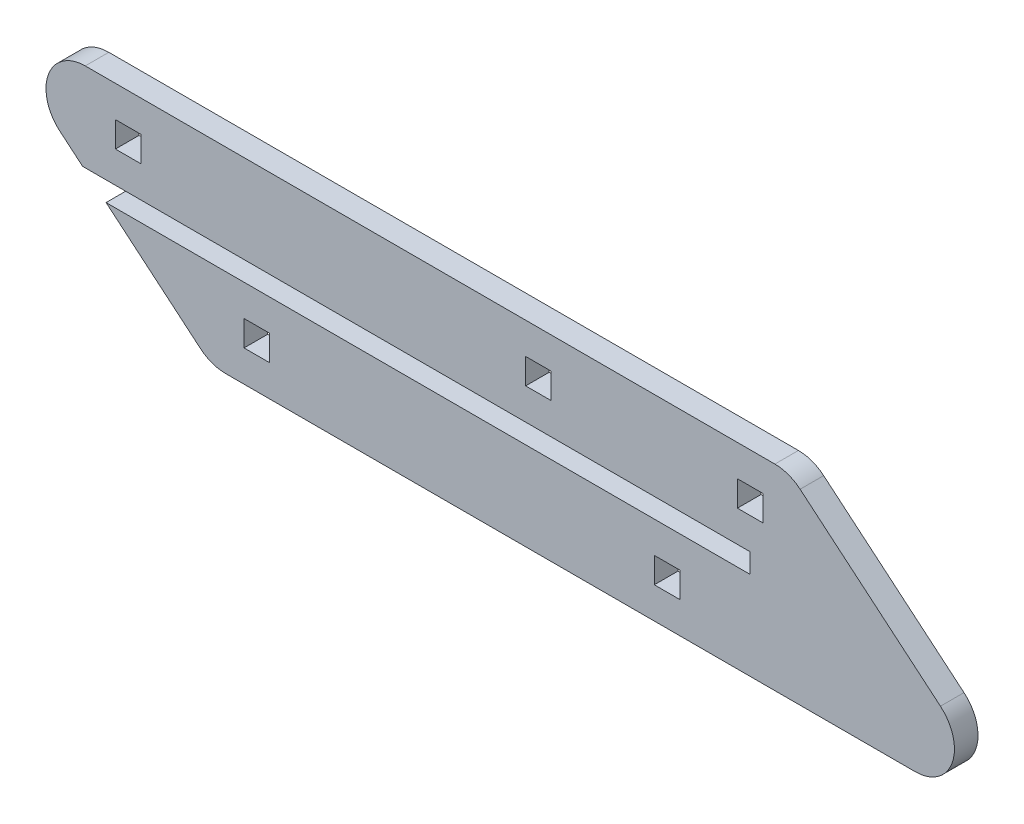
ISO-10303-21;
HEADER;
FILE_DESCRIPTION(('STEP AP214'),'2;1');
FILE_NAME('part.step','',(''),(''),'','','');
FILE_SCHEMA(('AUTOMOTIVE_DESIGN { 1 0 10303 214 1 1 1 1 }'));
ENDSEC;
DATA;
#1=APPLICATION_CONTEXT('core data for automotive mechanical design processes');
#2=APPLICATION_PROTOCOL_DEFINITION('international standard','automotive_design',2000,#1);
#3=PRODUCT_CONTEXT('',#1,'mechanical');
#4=PRODUCT('Part','Part','',(#3));
#5=PRODUCT_RELATED_PRODUCT_CATEGORY('part','',(#4));
#6=PRODUCT_DEFINITION_FORMATION('','',#4);
#7=PRODUCT_DEFINITION_CONTEXT('part definition',#1,'design');
#8=PRODUCT_DEFINITION('design','',#6,#7);
#9=PRODUCT_DEFINITION_SHAPE('','',#8);
#10=(LENGTH_UNIT() NAMED_UNIT(*) SI_UNIT(.MILLI.,.METRE.));
#11=(NAMED_UNIT(*) PLANE_ANGLE_UNIT() SI_UNIT($,.RADIAN.));
#12=(NAMED_UNIT(*) SI_UNIT($,.STERADIAN.) SOLID_ANGLE_UNIT());
#13=UNCERTAINTY_MEASURE_WITH_UNIT(LENGTH_MEASURE(1.E-05),#10,'distance_accuracy_value','');
#14=(GEOMETRIC_REPRESENTATION_CONTEXT(3) GLOBAL_UNCERTAINTY_ASSIGNED_CONTEXT((#13)) GLOBAL_UNIT_ASSIGNED_CONTEXT((#10,
#11,#12)) REPRESENTATION_CONTEXT('',''));
#15=CARTESIAN_POINT('',(0.,0.,0.));
#16=DIRECTION('',(0.,0.,1.));
#17=DIRECTION('',(1.,0.,0.));
#18=AXIS2_PLACEMENT_3D('',#15,#16,#17);
#19=CARTESIAN_POINT('',(-132.079334740666,-36.3,49.9999999999999));
#20=DIRECTION('',(-0.64278760968654,-0.766044443118977,0.));
#21=DIRECTION('',(0.,0.,1.));
#22=AXIS2_PLACEMENT_3D('',#19,#20,#21);
#23=PLANE('',#22);
#24=DIRECTION('',(0.,0.,-1.));
#25=VECTOR('',#24,1.);
#26=CARTESIAN_POINT('',(-158.893790574036,-13.8,62.0010000000001));
#27=LINE('',#26,#25);
#28=CARTESIAN_POINT('',(-158.893790574036,-13.7999999999999,56.));
#29=VERTEX_POINT('',#28);
#30=CARTESIAN_POINT('',(-158.893790574036,-13.7999999999999,50.));
#31=VERTEX_POINT('',#30);
#32=EDGE_CURVE('E354',#29,#31,#27,.T.);
#33=ORIENTED_EDGE('',*,*,#32,.T.);
#34=DIRECTION('',(-0.766044443118977,0.64278760968654,0.));
#35=VECTOR('',#34,1.);
#36=CARTESIAN_POINT('',(-132.079334740666,-36.3,49.9999999999999));
#37=LINE('',#36,#35);
#38=CARTESIAN_POINT('',(-134.86750849487,-33.9604444311897,49.9999999999999));
#39=VERTEX_POINT('',#38);
#40=EDGE_CURVE('E412',#39,#31,#37,.T.);
#41=ORIENTED_EDGE('',*,*,#40,.F.);
#42=DIRECTION('',(0.,0.,-1.));
#43=VECTOR('',#42,1.);
#44=CARTESIAN_POINT('',(-134.86750849487,-33.9604444311896,55.9999999999999));
#45=LINE('',#44,#43);
#46=CARTESIAN_POINT('',(-134.86750849487,-33.9604444311896,55.9999999999999));
#47=VERTEX_POINT('',#46);
#48=EDGE_CURVE('E443',#39,#47,#45,.F.);
#49=ORIENTED_EDGE('',*,*,#48,.T.);
#50=DIRECTION('',(0.766044443118977,-0.64278760968654,0.));
#51=VECTOR('',#50,1.);
#52=CARTESIAN_POINT('',(-132.079334740666,-36.2999999999999,55.9999999999999));
#53=LINE('',#52,#51);
#54=EDGE_CURVE('E402',#29,#47,#53,.T.);
#55=ORIENTED_EDGE('',*,*,#54,.F.);
#56=EDGE_LOOP('',(#33,#41,#49,#55));
#57=FACE_BOUND('',#56,.T.);
#58=ADVANCED_FACE('F38',(#57),#23,.T.);
#59=CARTESIAN_POINT('',(74.7329856296231,13.7,56.));
#60=DIRECTION('',(0.,-1.,0.));
#61=DIRECTION('',(0.,0.,-1.));
#62=AXIS2_PLACEMENT_3D('',#59,#60,#61);
#63=PLANE('',#62);
#64=DIRECTION('',(-1.,0.,0.));
#65=VECTOR('',#64,1.);
#66=CARTESIAN_POINT('',(74.7329856296232,13.7,50.));
#67=LINE('',#66,#65);
#68=CARTESIAN_POINT('',(11.5056036572507,13.7,50.));
#69=VERTEX_POINT('',#68);
#70=CARTESIAN_POINT('',(-164.19224017583,13.7000000000001,50.0000000000001));
#71=VERTEX_POINT('',#70);
#72=EDGE_CURVE('E386',#69,#71,#67,.T.);
#73=ORIENTED_EDGE('',*,*,#72,.T.);
#74=DIRECTION('',(0.,0.,1.));
#75=VECTOR('',#74,1.);
#76=CARTESIAN_POINT('',(-164.19224017583,13.7000000000001,56.));
#77=LINE('',#76,#75);
#78=CARTESIAN_POINT('',(-164.19224017583,13.7000000000001,56.));
#79=VERTEX_POINT('',#78);
#80=EDGE_CURVE('E463',#71,#79,#77,.T.);
#81=ORIENTED_EDGE('',*,*,#80,.T.);
#82=DIRECTION('',(-1.,0.,0.));
#83=VECTOR('',#82,1.);
#84=CARTESIAN_POINT('',(74.7329856296231,13.7,56.));
#85=LINE('',#84,#83);
#86=CARTESIAN_POINT('',(11.5056036572506,13.7,56.));
#87=VERTEX_POINT('',#86);
#88=EDGE_CURVE('E398',#87,#79,#85,.T.);
#89=ORIENTED_EDGE('',*,*,#88,.F.);
#90=DIRECTION('',(0.,0.,1.));
#91=VECTOR('',#90,1.);
#92=CARTESIAN_POINT('',(11.5056036572507,13.7,50.));
#93=LINE('',#92,#91);
#94=EDGE_CURVE('E459',#87,#69,#93,.F.);
#95=ORIENTED_EDGE('',*,*,#94,.T.);
#96=EDGE_LOOP('',(#73,#81,#89,#95));
#97=FACE_BOUND('',#96,.T.);
#98=ADVANCED_FACE('F657',(#97),#63,.F.);
#99=CARTESIAN_POINT('',(74.7329856296231,13.7,56.));
#100=DIRECTION('',(0.,0.,-1.));
#101=DIRECTION('',(0.,1.,0.));
#102=AXIS2_PLACEMENT_3D('',#99,#100,#101);
#103=PLANE('',#102);
#104=DIRECTION('',(-1.,0.,0.));
#105=VECTOR('',#104,1.);
#106=CARTESIAN_POINT('',(74.7329856296232,-0.799999999999967,56.0000000000001));
#107=LINE('',#106,#105);
#108=CARTESIAN_POINT('',(-150.009786453692,-0.799999999999967,56.));
#109=VERTEX_POINT('',#108);
#110=CARTESIAN_POINT('',(-156.509786453692,-0.799999999999912,56.));
#111=VERTEX_POINT('',#110);
#112=EDGE_CURVE('E334',#109,#111,#107,.T.);
#113=ORIENTED_EDGE('',*,*,#112,.T.);
#114=DIRECTION('',(0.,1.,0.));
#115=VECTOR('',#114,1.);
#116=CARTESIAN_POINT('',(-156.509786453692,13.6999999999999,56.));
#117=LINE('',#116,#115);
#118=CARTESIAN_POINT('',(-156.509786453692,5.70000000000015,56.));
#119=VERTEX_POINT('',#118);
#120=EDGE_CURVE('E346',#111,#119,#117,.T.);
#121=ORIENTED_EDGE('',*,*,#120,.T.);
#122=DIRECTION('',(1.,0.,0.));
#123=VECTOR('',#122,1.);
#124=CARTESIAN_POINT('',(74.7329856296232,5.69999999999998,56.));
#125=LINE('',#124,#123);
#126=CARTESIAN_POINT('',(-150.009786453692,5.70000000000004,56.));
#127=VERTEX_POINT('',#126);
#128=EDGE_CURVE('E342',#119,#127,#125,.T.);
#129=ORIENTED_EDGE('',*,*,#128,.T.);
#130=DIRECTION('',(0.,-1.,0.));
#131=VECTOR('',#130,1.);
#132=CARTESIAN_POINT('',(-150.009786453692,13.7000000000001,56.0000000000001));
#133=LINE('',#132,#131);
#134=EDGE_CURVE('E338',#127,#109,#133,.T.);
#135=ORIENTED_EDGE('',*,*,#134,.T.);
#136=EDGE_LOOP('',(#113,#121,#129,#135));
#137=FACE_BOUND('',#136,.T.);
#138=DIRECTION('',(1.,0.,0.));
#139=VECTOR('',#138,1.);
#140=CARTESIAN_POINT('',(74.7329856296232,5.69999999999998,56.));
#141=LINE('',#140,#139);
#142=CARTESIAN_POINT('',(-51.9897864536917,5.69999999999998,56.));
#143=VERTEX_POINT('',#142);
#144=CARTESIAN_POINT('',(-45.4897864536917,5.69999999999998,56.));
#145=VERTEX_POINT('',#144);
#146=EDGE_CURVE('E318',#143,#145,#141,.T.);
#147=ORIENTED_EDGE('',*,*,#146,.T.);
#148=DIRECTION('',(0.,-1.,0.));
#149=VECTOR('',#148,1.);
#150=CARTESIAN_POINT('',(-45.4897864536919,13.7000000000002,56.0000000000001));
#151=LINE('',#150,#149);
#152=CARTESIAN_POINT('',(-45.4897864536917,-0.799999999999856,56.));
#153=VERTEX_POINT('',#152);
#154=EDGE_CURVE('E330',#145,#153,#151,.T.);
#155=ORIENTED_EDGE('',*,*,#154,.T.);
#156=DIRECTION('',(-1.,0.,0.));
#157=VECTOR('',#156,1.);
#158=CARTESIAN_POINT('',(74.7329856296232,-0.799999999999967,56.0000000000001));
#159=LINE('',#158,#157);
#160=CARTESIAN_POINT('',(-51.9897864536918,-0.800000000000023,56.));
#161=VERTEX_POINT('',#160);
#162=EDGE_CURVE('E326',#153,#161,#159,.T.);
#163=ORIENTED_EDGE('',*,*,#162,.T.);
#164=DIRECTION('',(0.,1.,0.));
#165=VECTOR('',#164,1.);
#166=CARTESIAN_POINT('',(-51.9897864536918,13.7000000000001,56.));
#167=LINE('',#166,#165);
#168=EDGE_CURVE('E322',#161,#143,#167,.T.);
#169=ORIENTED_EDGE('',*,*,#168,.T.);
#170=EDGE_LOOP('',(#147,#155,#163,#169));
#171=FACE_BOUND('',#170,.T.);
#172=DIRECTION('',(1.,0.,0.));
#173=VECTOR('',#172,1.);
#174=CARTESIAN_POINT('',(74.7329856296232,-21.8,55.9999999999999));
#175=LINE('',#174,#173);
#176=CARTESIAN_POINT('',(-123.736562657351,-21.8,55.9999999999999));
#177=VERTEX_POINT('',#176);
#178=CARTESIAN_POINT('',(-117.236562657351,-21.8,56.));
#179=VERTEX_POINT('',#178);
#180=EDGE_CURVE('E302',#177,#179,#175,.T.);
#181=ORIENTED_EDGE('',*,*,#180,.T.);
#182=DIRECTION('',(0.,-1.,0.));
#183=VECTOR('',#182,1.);
#184=CARTESIAN_POINT('',(-117.236562657351,13.7000000000002,56.0000000000001));
#185=LINE('',#184,#183);
#186=CARTESIAN_POINT('',(-117.236562657351,-28.3,55.9999999999999));
#187=VERTEX_POINT('',#186);
#188=EDGE_CURVE('E314',#179,#187,#185,.T.);
#189=ORIENTED_EDGE('',*,*,#188,.T.);
#190=DIRECTION('',(-1.,0.,0.));
#191=VECTOR('',#190,1.);
#192=CARTESIAN_POINT('',(74.7329856296231,-28.2999999999999,56.));
#193=LINE('',#192,#191);
#194=CARTESIAN_POINT('',(-123.736562657351,-28.3,55.9999999999999));
#195=VERTEX_POINT('',#194);
#196=EDGE_CURVE('E310',#187,#195,#193,.T.);
#197=ORIENTED_EDGE('',*,*,#196,.T.);
#198=DIRECTION('',(0.,1.,0.));
#199=VECTOR('',#198,1.);
#200=CARTESIAN_POINT('',(-123.736562657351,13.7,56.));
#201=LINE('',#200,#199);
#202=EDGE_CURVE('E306',#195,#177,#201,.T.);
#203=ORIENTED_EDGE('',*,*,#202,.T.);
#204=EDGE_LOOP('',(#181,#189,#197,#203));
#205=FACE_BOUND('',#204,.T.);
#206=DIRECTION('',(1.,0.,0.));
#207=VECTOR('',#206,1.);
#208=CARTESIAN_POINT('',(74.7329856296232,-21.8,55.9999999999999));
#209=LINE('',#208,#207);
#210=CARTESIAN_POINT('',(-19.216562657351,-21.8,55.9999999999999));
#211=VERTEX_POINT('',#210);
#212=CARTESIAN_POINT('',(-12.7165626573511,-21.7999999999999,55.9999999999999));
#213=VERTEX_POINT('',#212);
#214=EDGE_CURVE('E286',#211,#213,#209,.T.);
#215=ORIENTED_EDGE('',*,*,#214,.T.);
#216=DIRECTION('',(0.,-1.,0.));
#217=VECTOR('',#216,1.);
#218=CARTESIAN_POINT('',(-12.716562657351,13.7,56.));
#219=LINE('',#218,#217);
#220=CARTESIAN_POINT('',(-12.7165626573511,-28.3,55.9999999999999));
#221=VERTEX_POINT('',#220);
#222=EDGE_CURVE('E298',#213,#221,#219,.T.);
#223=ORIENTED_EDGE('',*,*,#222,.T.);
#224=DIRECTION('',(-1.,0.,0.));
#225=VECTOR('',#224,1.);
#226=CARTESIAN_POINT('',(74.7329856296231,-28.2999999999999,56.));
#227=LINE('',#226,#225);
#228=CARTESIAN_POINT('',(-19.2165626573512,-28.2999999999999,56.));
#229=VERTEX_POINT('',#228);
#230=EDGE_CURVE('E294',#221,#229,#227,.T.);
#231=ORIENTED_EDGE('',*,*,#230,.T.);
#232=DIRECTION('',(0.,1.,0.));
#233=VECTOR('',#232,1.);
#234=CARTESIAN_POINT('',(-19.2165626573512,13.7000000000002,56.));
#235=LINE('',#234,#233);
#236=EDGE_CURVE('E290',#229,#211,#235,.T.);
#237=ORIENTED_EDGE('',*,*,#236,.T.);
#238=EDGE_LOOP('',(#215,#223,#231,#237));
#239=FACE_BOUND('',#238,.T.);
#240=DIRECTION('',(1.,0.,0.));
#241=VECTOR('',#240,1.);
#242=CARTESIAN_POINT('',(74.7329856296232,5.69999999999998,56.));
#243=LINE('',#242,#241);
#244=CARTESIAN_POINT('',(1.96667651369142,5.69999999999993,56.));
#245=VERTEX_POINT('',#244);
#246=CARTESIAN_POINT('',(8.46667651369126,5.70000000000009,56.));
#247=VERTEX_POINT('',#246);
#248=EDGE_CURVE('E247',#245,#247,#243,.T.);
#249=ORIENTED_EDGE('',*,*,#248,.T.);
#250=DIRECTION('',(0.,-1.,0.));
#251=VECTOR('',#250,1.);
#252=CARTESIAN_POINT('',(8.46667651369126,13.7000000000002,56.0000000000001));
#253=LINE('',#252,#251);
#254=CARTESIAN_POINT('',(8.46667651369132,-0.800000000000023,56.));
#255=VERTEX_POINT('',#254);
#256=EDGE_CURVE('E280',#247,#255,#253,.T.);
#257=ORIENTED_EDGE('',*,*,#256,.T.);
#258=DIRECTION('',(-1.,0.,0.));
#259=VECTOR('',#258,1.);
#260=CARTESIAN_POINT('',(74.7329856296232,-0.799999999999967,56.0000000000001));
#261=LINE('',#260,#259);
#262=CARTESIAN_POINT('',(1.96667651369126,-0.799999999999967,56.0000000000001));
#263=VERTEX_POINT('',#262);
#264=EDGE_CURVE('E275',#255,#263,#261,.T.);
#265=ORIENTED_EDGE('',*,*,#264,.T.);
#266=DIRECTION('',(0.,1.,0.));
#267=VECTOR('',#266,1.);
#268=CARTESIAN_POINT('',(1.96667651369137,13.7,56.));
#269=LINE('',#268,#267);
#270=EDGE_CURVE('E259',#263,#245,#269,.T.);
#271=ORIENTED_EDGE('',*,*,#270,.T.);
#272=EDGE_LOOP('',(#249,#257,#265,#271));
#273=FACE_BOUND('',#272,.T.);
#274=DIRECTION('',(0.,1.,0.));
#275=VECTOR('',#274,1.);
#276=CARTESIAN_POINT('',(5.14744146299317,-8.79999999999997,56.));
#277=LINE('',#276,#275);
#278=CARTESIAN_POINT('',(5.14744146299317,-13.8,56.));
#279=VERTEX_POINT('',#278);
#280=CARTESIAN_POINT('',(5.14744146299317,-8.79999999999997,56.));
#281=VERTEX_POINT('',#280);
#282=EDGE_CURVE('E358',#279,#281,#277,.T.);
#283=ORIENTED_EDGE('',*,*,#282,.F.);
#284=DIRECTION('',(1.,0.,0.));
#285=VECTOR('',#284,1.);
#286=CARTESIAN_POINT('',(-164.852558537007,-13.8,55.9999999999999));
#287=LINE('',#286,#285);
#288=EDGE_CURVE('E362',#29,#279,#287,.T.);
#289=ORIENTED_EDGE('',*,*,#288,.F.);
#290=ORIENTED_EDGE('',*,*,#54,.T.);
#291=CARTESIAN_POINT('',(-128.439632398004,-26.2999999999999,55.9999999999999));
#292=DIRECTION('',(0.,0.,-1.));
#293=DIRECTION('',(0.,1.,0.));
#294=AXIS2_PLACEMENT_3D('',#291,#292,#293);
#295=CIRCLE('',#294,10.);
#296=CARTESIAN_POINT('',(-128.439632398004,-36.2999999999999,55.9999999999999));
#297=VERTEX_POINT('',#296);
#298=EDGE_CURVE('E456',#47,#297,#295,.F.);
#299=ORIENTED_EDGE('',*,*,#298,.T.);
#300=DIRECTION('',(-1.,0.,0.));
#301=VECTOR('',#300,1.);
#302=CARTESIAN_POINT('',(74.7329856296232,-36.2999999999999,55.9999999999999));
#303=LINE('',#302,#301);
#304=CARTESIAN_POINT('',(47.2582114350769,-36.3000000000001,56.));
#305=VERTEX_POINT('',#304);
#306=EDGE_CURVE('E394',#305,#297,#303,.T.);
#307=ORIENTED_EDGE('',*,*,#306,.F.);
#308=CARTESIAN_POINT('',(47.2582114350769,-26.3,55.9999999999999));
#309=DIRECTION('',(0.,0.,-1.));
#310=DIRECTION('',(0.,1.,0.));
#311=AXIS2_PLACEMENT_3D('',#308,#309,#310);
#312=CIRCLE('',#311,10.);
#313=CARTESIAN_POINT('',(53.6860875319421,-18.6395555688103,56.));
#314=VERTEX_POINT('',#313);
#315=EDGE_CURVE('E450',#305,#314,#312,.F.);
#316=ORIENTED_EDGE('',*,*,#315,.T.);
#317=DIRECTION('',(0.766044443118977,-0.642787609686541,0.));
#318=VECTOR('',#317,1.);
#319=CARTESIAN_POINT('',(74.7329856296232,-36.3000000000002,55.9999999999999));
#320=LINE('',#319,#318);
#321=CARTESIAN_POINT('',(17.9334797541161,11.3604444311898,56.0000000000001));
#322=VERTEX_POINT('',#321);
#323=EDGE_CURVE('E407',#314,#322,#320,.F.);
#324=ORIENTED_EDGE('',*,*,#323,.T.);
#325=CARTESIAN_POINT('',(11.5056036572507,3.69999999999998,56.));
#326=DIRECTION('',(0.,0.,-1.));
#327=DIRECTION('',(0.,1.,0.));
#328=AXIS2_PLACEMENT_3D('',#325,#326,#327);
#329=CIRCLE('',#328,10.);
#330=EDGE_CURVE('E447',#322,#87,#329,.F.);
#331=ORIENTED_EDGE('',*,*,#330,.T.);
#332=ORIENTED_EDGE('',*,*,#88,.T.);
#333=CARTESIAN_POINT('',(-164.19224017583,3.70000000000004,56.));
#334=DIRECTION('',(0.,0.,-1.));
#335=DIRECTION('',(0.,1.,0.));
#336=AXIS2_PLACEMENT_3D('',#333,#334,#335);
#337=CIRCLE('',#336,10.);
#338=CARTESIAN_POINT('',(-170.620116272696,-3.96044443118976,56.));
#339=VERTEX_POINT('',#338);
#340=EDGE_CURVE('E453',#79,#339,#337,.F.);
#341=ORIENTED_EDGE('',*,*,#340,.T.);
#342=CARTESIAN_POINT('',(-164.852558537007,-8.80000000000003,56.));
#343=VERTEX_POINT('',#342);
#344=EDGE_CURVE('E403',#339,#343,#53,.T.);
#345=ORIENTED_EDGE('',*,*,#344,.T.);
#346=DIRECTION('',(-1.,0.,0.));
#347=VECTOR('',#346,1.);
#348=CARTESIAN_POINT('',(-164.852558537007,-8.80000000000003,56.));
#349=LINE('',#348,#347);
#350=EDGE_CURVE('E381',#281,#343,#349,.T.);
#351=ORIENTED_EDGE('',*,*,#350,.F.);
#352=EDGE_LOOP('',(#283,#289,#290,#299,#307,#316,#324,#331,#332,#341,#345,#351));
#353=FACE_BOUND('',#352,.T.);
#354=ADVANCED_FACE('F273',(#137,#171,#205,#239,#273,#353),#103,.F.);
#355=CARTESIAN_POINT('',(74.7329856296232,-36.2999999999999,49.9999999999999));
#356=DIRECTION('',(0.,1.,0.));
#357=DIRECTION('',(0.,0.,1.));
#358=AXIS2_PLACEMENT_3D('',#355,#356,#357);
#359=PLANE('',#358);
#360=ORIENTED_EDGE('',*,*,#306,.T.);
#361=DIRECTION('',(0.,0.,-1.));
#362=VECTOR('',#361,1.);
#363=CARTESIAN_POINT('',(-128.439632398004,-36.3,49.9999999999999));
#364=LINE('',#363,#362);
#365=CARTESIAN_POINT('',(-128.439632398004,-36.3,49.9999999999999));
#366=VERTEX_POINT('',#365);
#367=EDGE_CURVE('E423',#297,#366,#364,.T.);
#368=ORIENTED_EDGE('',*,*,#367,.T.);
#369=DIRECTION('',(-1.,0.,0.));
#370=VECTOR('',#369,1.);
#371=CARTESIAN_POINT('',(74.7329856296232,-36.2999999999999,49.9999999999999));
#372=LINE('',#371,#370);
#373=CARTESIAN_POINT('',(47.2582114350769,-36.3,50.));
#374=VERTEX_POINT('',#373);
#375=EDGE_CURVE('E390',#374,#366,#372,.T.);
#376=ORIENTED_EDGE('',*,*,#375,.F.);
#377=DIRECTION('',(0.,0.,1.));
#378=VECTOR('',#377,1.);
#379=CARTESIAN_POINT('',(47.2582114350769,-36.3000000000001,56.));
#380=LINE('',#379,#378);
#381=EDGE_CURVE('E420',#374,#305,#380,.T.);
#382=ORIENTED_EDGE('',*,*,#381,.T.);
#383=EDGE_LOOP('',(#360,#368,#376,#382));
#384=FACE_BOUND('',#383,.T.);
#385=ADVANCED_FACE('F639',(#384),#359,.F.);
#386=CARTESIAN_POINT('',(74.7329856296232,13.7,50.));
#387=DIRECTION('',(0.,0.,1.));
#388=DIRECTION('',(0.,-1.,0.));
#389=AXIS2_PLACEMENT_3D('',#386,#387,#388);
#390=PLANE('',#389);
#391=DIRECTION('',(-1.,0.,0.));
#392=VECTOR('',#391,1.);
#393=CARTESIAN_POINT('',(74.7329856296233,5.70000000000004,50.));
#394=LINE('',#393,#392);
#395=CARTESIAN_POINT('',(-150.009786453692,5.70000000000009,50.));
#396=VERTEX_POINT('',#395);
#397=CARTESIAN_POINT('',(-156.509786453692,5.70000000000009,50.));
#398=VERTEX_POINT('',#397);
#399=EDGE_CURVE('E47',#396,#398,#394,.T.);
#400=ORIENTED_EDGE('',*,*,#399,.T.);
#401=DIRECTION('',(0.,-1.,0.));
#402=VECTOR('',#401,1.);
#403=CARTESIAN_POINT('',(-156.509786453692,13.7,50.0000000000001));
#404=LINE('',#403,#402);
#405=CARTESIAN_POINT('',(-156.509786453692,-0.800000000000023,50.));
#406=VERTEX_POINT('',#405);
#407=EDGE_CURVE('E11',#398,#406,#404,.T.);
#408=ORIENTED_EDGE('',*,*,#407,.T.);
#409=DIRECTION('',(1.,0.,0.));
#410=VECTOR('',#409,1.);
#411=CARTESIAN_POINT('',(74.7329856296232,-0.799999999999967,50.0000000000001));
#412=LINE('',#411,#410);
#413=CARTESIAN_POINT('',(-150.009786453692,-0.800000000000023,50.));
#414=VERTEX_POINT('',#413);
#415=EDGE_CURVE('E535',#406,#414,#412,.T.);
#416=ORIENTED_EDGE('',*,*,#415,.T.);
#417=DIRECTION('',(0.,1.,0.));
#418=VECTOR('',#417,1.);
#419=CARTESIAN_POINT('',(-150.009786453692,13.7000000000001,50.0000000000002));
#420=LINE('',#419,#418);
#421=EDGE_CURVE('E539',#414,#396,#420,.T.);
#422=ORIENTED_EDGE('',*,*,#421,.T.);
#423=EDGE_LOOP('',(#400,#408,#416,#422));
#424=FACE_BOUND('',#423,.T.);
#425=DIRECTION('',(1.,0.,0.));
#426=VECTOR('',#425,1.);
#427=CARTESIAN_POINT('',(74.7329856296233,-0.800000000000078,50.0000000000001));
#428=LINE('',#427,#426);
#429=CARTESIAN_POINT('',(-51.9897864536919,-0.799999999999912,50.));
#430=VERTEX_POINT('',#429);
#431=CARTESIAN_POINT('',(-45.4897864536917,-0.800000000000023,50.));
#432=VERTEX_POINT('',#431);
#433=EDGE_CURVE('E527',#430,#432,#428,.T.);
#434=ORIENTED_EDGE('',*,*,#433,.T.);
#435=DIRECTION('',(0.,1.,0.));
#436=VECTOR('',#435,1.);
#437=CARTESIAN_POINT('',(-45.4897864536917,13.7,50.0000000000002));
#438=LINE('',#437,#436);
#439=CARTESIAN_POINT('',(-45.4897864536917,5.70000000000009,50.));
#440=VERTEX_POINT('',#439);
#441=EDGE_CURVE('E531',#432,#440,#438,.T.);
#442=ORIENTED_EDGE('',*,*,#441,.T.);
#443=DIRECTION('',(-1.,0.,0.));
#444=VECTOR('',#443,1.);
#445=CARTESIAN_POINT('',(74.7329856296232,5.70000000000009,50.));
#446=LINE('',#445,#444);
#447=CARTESIAN_POINT('',(-51.9897864536917,5.69999999999998,50.));
#448=VERTEX_POINT('',#447);
#449=EDGE_CURVE('E519',#440,#448,#446,.T.);
#450=ORIENTED_EDGE('',*,*,#449,.T.);
#451=DIRECTION('',(0.,-1.,0.));
#452=VECTOR('',#451,1.);
#453=CARTESIAN_POINT('',(-51.9897864536918,13.7000000000001,50.0000000000001));
#454=LINE('',#453,#452);
#455=EDGE_CURVE('E523',#448,#430,#454,.T.);
#456=ORIENTED_EDGE('',*,*,#455,.T.);
#457=EDGE_LOOP('',(#434,#442,#450,#456));
#458=FACE_BOUND('',#457,.T.);
#459=DIRECTION('',(1.,0.,0.));
#460=VECTOR('',#459,1.);
#461=CARTESIAN_POINT('',(74.7329856296232,-28.3,50.));
#462=LINE('',#461,#460);
#463=CARTESIAN_POINT('',(-123.736562657351,-28.3,49.9999999999999));
#464=VERTEX_POINT('',#463);
#465=CARTESIAN_POINT('',(-117.236562657351,-28.3,49.9999999999999));
#466=VERTEX_POINT('',#465);
#467=EDGE_CURVE('E511',#464,#466,#462,.T.);
#468=ORIENTED_EDGE('',*,*,#467,.T.);
#469=DIRECTION('',(0.,1.,0.));
#470=VECTOR('',#469,1.);
#471=CARTESIAN_POINT('',(-117.236562657351,13.7,50.0000000000001));
#472=LINE('',#471,#470);
#473=CARTESIAN_POINT('',(-117.236562657351,-21.8000000000001,50.));
#474=VERTEX_POINT('',#473);
#475=EDGE_CURVE('E515',#466,#474,#472,.T.);
#476=ORIENTED_EDGE('',*,*,#475,.T.);
#477=DIRECTION('',(-1.,0.,0.));
#478=VECTOR('',#477,1.);
#479=CARTESIAN_POINT('',(74.7329856296232,-21.8,49.9999999999999));
#480=LINE('',#479,#478);
#481=CARTESIAN_POINT('',(-123.736562657351,-21.8,49.9999999999999));
#482=VERTEX_POINT('',#481);
#483=EDGE_CURVE('E503',#474,#482,#480,.T.);
#484=ORIENTED_EDGE('',*,*,#483,.T.);
#485=DIRECTION('',(0.,-1.,0.));
#486=VECTOR('',#485,1.);
#487=CARTESIAN_POINT('',(-123.736562657351,13.7000000000001,50.0000000000001));
#488=LINE('',#487,#486);
#489=EDGE_CURVE('E507',#482,#464,#488,.T.);
#490=ORIENTED_EDGE('',*,*,#489,.T.);
#491=EDGE_LOOP('',(#468,#476,#484,#490));
#492=FACE_BOUND('',#491,.T.);
#493=DIRECTION('',(1.,0.,0.));
#494=VECTOR('',#493,1.);
#495=CARTESIAN_POINT('',(74.7329856296232,-28.3,50.));
#496=LINE('',#495,#494);
#497=CARTESIAN_POINT('',(-19.2165626573512,-28.2999999999999,50.));
#498=VERTEX_POINT('',#497);
#499=CARTESIAN_POINT('',(-12.716562657351,-28.3,49.9999999999999));
#500=VERTEX_POINT('',#499);
#501=EDGE_CURVE('E495',#498,#500,#496,.T.);
#502=ORIENTED_EDGE('',*,*,#501,.T.);
#503=DIRECTION('',(0.,1.,0.));
#504=VECTOR('',#503,1.);
#505=CARTESIAN_POINT('',(-12.716562657351,13.7,50.0000000000001));
#506=LINE('',#505,#504);
#507=CARTESIAN_POINT('',(-12.716562657351,-21.8,49.9999999999999));
#508=VERTEX_POINT('',#507);
#509=EDGE_CURVE('E499',#500,#508,#506,.T.);
#510=ORIENTED_EDGE('',*,*,#509,.T.);
#511=DIRECTION('',(-1.,0.,0.));
#512=VECTOR('',#511,1.);
#513=CARTESIAN_POINT('',(74.7329856296232,-21.8,49.9999999999999));
#514=LINE('',#513,#512);
#515=CARTESIAN_POINT('',(-19.216562657351,-21.8,49.9999999999999));
#516=VERTEX_POINT('',#515);
#517=EDGE_CURVE('E487',#508,#516,#514,.T.);
#518=ORIENTED_EDGE('',*,*,#517,.T.);
#519=DIRECTION('',(0.,-1.,0.));
#520=VECTOR('',#519,1.);
#521=CARTESIAN_POINT('',(-19.2165626573511,13.7,50.));
#522=LINE('',#521,#520);
#523=EDGE_CURVE('E491',#516,#498,#522,.T.);
#524=ORIENTED_EDGE('',*,*,#523,.T.);
#525=EDGE_LOOP('',(#502,#510,#518,#524));
#526=FACE_BOUND('',#525,.T.);
#527=DIRECTION('',(1.,0.,0.));
#528=VECTOR('',#527,1.);
#529=CARTESIAN_POINT('',(74.7329856296233,-0.800000000000078,50.0000000000001));
#530=LINE('',#529,#528);
#531=CARTESIAN_POINT('',(1.96667651369137,-0.800000000000078,50.0000000000001));
#532=VERTEX_POINT('',#531);
#533=CARTESIAN_POINT('',(8.46667651369126,-0.799999999999912,50.));
#534=VERTEX_POINT('',#533);
#535=EDGE_CURVE('E479',#532,#534,#530,.T.);
#536=ORIENTED_EDGE('',*,*,#535,.T.);
#537=DIRECTION('',(0.,1.,0.));
#538=VECTOR('',#537,1.);
#539=CARTESIAN_POINT('',(8.46667651369126,13.7000000000002,50.0000000000001));
#540=LINE('',#539,#538);
#541=CARTESIAN_POINT('',(8.46667651369132,5.70000000000004,50.));
#542=VERTEX_POINT('',#541);
#543=EDGE_CURVE('E483',#534,#542,#540,.T.);
#544=ORIENTED_EDGE('',*,*,#543,.T.);
#545=DIRECTION('',(-1.,0.,0.));
#546=VECTOR('',#545,1.);
#547=CARTESIAN_POINT('',(74.7329856296232,5.70000000000009,50.));
#548=LINE('',#547,#546);
#549=CARTESIAN_POINT('',(1.96667651369137,5.69999999999998,50.));
#550=VERTEX_POINT('',#549);
#551=EDGE_CURVE('E474',#542,#550,#548,.T.);
#552=ORIENTED_EDGE('',*,*,#551,.T.);
#553=DIRECTION('',(0.,-1.,0.));
#554=VECTOR('',#553,1.);
#555=CARTESIAN_POINT('',(1.96667651369137,13.7,50.0000000000001));
#556=LINE('',#555,#554);
#557=EDGE_CURVE('E267',#550,#532,#556,.T.);
#558=ORIENTED_EDGE('',*,*,#557,.T.);
#559=EDGE_LOOP('',(#536,#544,#552,#558));
#560=FACE_BOUND('',#559,.T.);
#561=ORIENTED_EDGE('',*,*,#40,.T.);
#562=DIRECTION('',(-1.,0.,0.));
#563=VECTOR('',#562,1.);
#564=CARTESIAN_POINT('',(-164.852558537007,-13.8,50.));
#565=LINE('',#564,#563);
#566=CARTESIAN_POINT('',(5.14744146299323,-13.8,50.));
#567=VERTEX_POINT('',#566);
#568=EDGE_CURVE('E374',#567,#31,#565,.T.);
#569=ORIENTED_EDGE('',*,*,#568,.F.);
#570=DIRECTION('',(0.,-1.,0.));
#571=VECTOR('',#570,1.);
#572=CARTESIAN_POINT('',(5.14744146299301,-8.79999999999992,50.));
#573=LINE('',#572,#571);
#574=CARTESIAN_POINT('',(5.14744146299301,-8.79999999999992,50.));
#575=VERTEX_POINT('',#574);
#576=EDGE_CURVE('E370',#575,#567,#573,.T.);
#577=ORIENTED_EDGE('',*,*,#576,.F.);
#578=DIRECTION('',(1.,0.,0.));
#579=VECTOR('',#578,1.);
#580=CARTESIAN_POINT('',(-164.852558537007,-8.80000000000003,50.));
#581=LINE('',#580,#579);
#582=CARTESIAN_POINT('',(-164.852558537007,-8.80000000000003,50.));
#583=VERTEX_POINT('',#582);
#584=EDGE_CURVE('E366',#583,#575,#581,.T.);
#585=ORIENTED_EDGE('',*,*,#584,.F.);
#586=CARTESIAN_POINT('',(-170.620116272696,-3.96044443118965,50.));
#587=VERTEX_POINT('',#586);
#588=EDGE_CURVE('E411',#583,#587,#37,.T.);
#589=ORIENTED_EDGE('',*,*,#588,.T.);
#590=CARTESIAN_POINT('',(-164.19224017583,3.70000000000004,50.));
#591=DIRECTION('',(0.,0.,1.));
#592=DIRECTION('',(0.,-1.,0.));
#593=AXIS2_PLACEMENT_3D('',#590,#591,#592);
#594=CIRCLE('',#593,10.);
#595=EDGE_CURVE('E433',#587,#71,#594,.F.);
#596=ORIENTED_EDGE('',*,*,#595,.T.);
#597=ORIENTED_EDGE('',*,*,#72,.F.);
#598=CARTESIAN_POINT('',(11.5056036572507,3.70000000000004,50.));
#599=DIRECTION('',(0.,0.,1.));
#600=DIRECTION('',(0.,-1.,0.));
#601=AXIS2_PLACEMENT_3D('',#598,#599,#600);
#602=CIRCLE('',#601,10.);
#603=CARTESIAN_POINT('',(17.9334797541161,11.3604444311898,50.0000000000001));
#604=VERTEX_POINT('',#603);
#605=EDGE_CURVE('E427',#69,#604,#602,.F.);
#606=ORIENTED_EDGE('',*,*,#605,.T.);
#607=DIRECTION('',(-0.766044443118977,0.642787609686541,0.));
#608=VECTOR('',#607,1.);
#609=CARTESIAN_POINT('',(74.7329856296232,-36.3000000000002,49.9999999999999));
#610=LINE('',#609,#608);
#611=CARTESIAN_POINT('',(53.6860875319423,-18.6395555688102,50.));
#612=VERTEX_POINT('',#611);
#613=EDGE_CURVE('E416',#604,#612,#610,.F.);
#614=ORIENTED_EDGE('',*,*,#613,.T.);
#615=CARTESIAN_POINT('',(47.2582114350769,-26.2999999999999,49.9999999999999));
#616=DIRECTION('',(0.,0.,1.));
#617=DIRECTION('',(0.,-1.,0.));
#618=AXIS2_PLACEMENT_3D('',#615,#616,#617);
#619=CIRCLE('',#618,10.);
#620=EDGE_CURVE('E430',#612,#374,#619,.F.);
#621=ORIENTED_EDGE('',*,*,#620,.T.);
#622=ORIENTED_EDGE('',*,*,#375,.T.);
#623=CARTESIAN_POINT('',(-128.439632398004,-26.2999999999999,49.9999999999999));
#624=DIRECTION('',(0.,0.,1.));
#625=DIRECTION('',(0.,-1.,0.));
#626=AXIS2_PLACEMENT_3D('',#623,#624,#625);
#627=CIRCLE('',#626,10.);
#628=EDGE_CURVE('E436',#366,#39,#627,.F.);
#629=ORIENTED_EDGE('',*,*,#628,.T.);
#630=EDGE_LOOP('',(#561,#569,#577,#585,#589,#596,#597,#606,#614,#621,#622,#629));
#631=FACE_BOUND('',#630,.T.);
#632=ADVANCED_FACE('F547',(#424,#458,#492,#526,#560,#631),#390,.F.);
#633=CARTESIAN_POINT('',(74.7329856296232,-36.2999999999998,2.99999999999989));
#634=DIRECTION('',(-0.642787609686541,-0.766044443118977,0.));
#635=DIRECTION('',(0.,0.,1.));
#636=AXIS2_PLACEMENT_3D('',#633,#634,#635);
#637=PLANE('',#636);
#638=ORIENTED_EDGE('',*,*,#323,.F.);
#639=DIRECTION('',(0.,0.,-1.));
#640=VECTOR('',#639,1.);
#641=CARTESIAN_POINT('',(53.6860875319423,-18.6395555688102,50.));
#642=LINE('',#641,#640);
#643=EDGE_CURVE('E470',#314,#612,#642,.T.);
#644=ORIENTED_EDGE('',*,*,#643,.T.);
#645=ORIENTED_EDGE('',*,*,#613,.F.);
#646=DIRECTION('',(0.,0.,-1.));
#647=VECTOR('',#646,1.);
#648=CARTESIAN_POINT('',(17.9334797541161,11.3604444311898,56.0000000000001));
#649=LINE('',#648,#647);
#650=EDGE_CURVE('E467',#604,#322,#649,.F.);
#651=ORIENTED_EDGE('',*,*,#650,.T.);
#652=EDGE_LOOP('',(#638,#644,#645,#651));
#653=FACE_BOUND('',#652,.T.);
#654=ADVANCED_FACE('F649',(#653),#637,.F.);
#655=DIRECTION('',(0.,0.,1.));
#656=VECTOR('',#655,1.);
#657=CARTESIAN_POINT('',(-164.852558537007,-8.80000000000003,62.0010000000002));
#658=LINE('',#657,#656);
#659=EDGE_CURVE('E350',#583,#343,#658,.T.);
#660=ORIENTED_EDGE('',*,*,#659,.T.);
#661=ORIENTED_EDGE('',*,*,#344,.F.);
#662=DIRECTION('',(0.,0.,1.));
#663=VECTOR('',#662,1.);
#664=CARTESIAN_POINT('',(-170.620116272696,-3.96044443118981,50.));
#665=LINE('',#664,#663);
#666=EDGE_CURVE('E439',#339,#587,#665,.F.);
#667=ORIENTED_EDGE('',*,*,#666,.T.);
#668=ORIENTED_EDGE('',*,*,#588,.F.);
#669=EDGE_LOOP('',(#660,#661,#667,#668));
#670=FACE_BOUND('',#669,.T.);
#671=ADVANCED_FACE('F668',(#670),#23,.T.);
#672=CARTESIAN_POINT('',(-128.439632398004,-26.2999999999999,49.9999999999999));
#673=DIRECTION('',(0.,0.,1.));
#674=DIRECTION('',(0.,-1.,0.));
#675=AXIS2_PLACEMENT_3D('',#672,#673,#674);
#676=CYLINDRICAL_SURFACE('',#675,10.);
#677=ORIENTED_EDGE('',*,*,#298,.F.);
#678=ORIENTED_EDGE('',*,*,#48,.F.);
#679=ORIENTED_EDGE('',*,*,#628,.F.);
#680=ORIENTED_EDGE('',*,*,#367,.F.);
#681=EDGE_LOOP('',(#677,#678,#679,#680));
#682=FACE_BOUND('',#681,.T.);
#683=ADVANCED_FACE('F636',(#682),#676,.T.);
#684=CARTESIAN_POINT('',(-164.19224017583,3.70000000000004,56.));
#685=DIRECTION('',(0.,0.,-1.));
#686=DIRECTION('',(0.,1.,0.));
#687=AXIS2_PLACEMENT_3D('',#684,#685,#686);
#688=CYLINDRICAL_SURFACE('',#687,10.);
#689=ORIENTED_EDGE('',*,*,#595,.F.);
#690=ORIENTED_EDGE('',*,*,#666,.F.);
#691=ORIENTED_EDGE('',*,*,#340,.F.);
#692=ORIENTED_EDGE('',*,*,#80,.F.);
#693=EDGE_LOOP('',(#689,#690,#691,#692));
#694=FACE_BOUND('',#693,.T.);
#695=ADVANCED_FACE('F664',(#694),#688,.T.);
#696=CARTESIAN_POINT('',(47.2582114350769,-26.2999999999997,2.99999999999984));
#697=DIRECTION('',(0.,0.,-1.));
#698=DIRECTION('',(0.,1.,0.));
#699=AXIS2_PLACEMENT_3D('',#696,#697,#698);
#700=CYLINDRICAL_SURFACE('',#699,10.);
#701=ORIENTED_EDGE('',*,*,#315,.F.);
#702=ORIENTED_EDGE('',*,*,#381,.F.);
#703=ORIENTED_EDGE('',*,*,#620,.F.);
#704=ORIENTED_EDGE('',*,*,#643,.F.);
#705=EDGE_LOOP('',(#701,#702,#703,#704));
#706=FACE_BOUND('',#705,.T.);
#707=ADVANCED_FACE('F646',(#706),#700,.T.);
#708=CARTESIAN_POINT('',(11.5056036572507,3.69999999999998,56.));
#709=DIRECTION('',(0.,0.,-1.));
#710=DIRECTION('',(0.,1.,0.));
#711=AXIS2_PLACEMENT_3D('',#708,#709,#710);
#712=CYLINDRICAL_SURFACE('',#711,10.);
#713=ORIENTED_EDGE('',*,*,#330,.F.);
#714=ORIENTED_EDGE('',*,*,#650,.F.);
#715=ORIENTED_EDGE('',*,*,#605,.F.);
#716=ORIENTED_EDGE('',*,*,#94,.F.);
#717=EDGE_LOOP('',(#713,#714,#715,#716));
#718=FACE_BOUND('',#717,.T.);
#719=ADVANCED_FACE('F40',(#718),#712,.T.);
#720=CARTESIAN_POINT('',(-164.852558537007,-13.8,62.0010000000001));
#721=DIRECTION('',(0.,-1.,0.));
#722=DIRECTION('',(0.,0.,-1.));
#723=AXIS2_PLACEMENT_3D('',#720,#721,#722);
#724=PLANE('',#723);
#725=ORIENTED_EDGE('',*,*,#288,.T.);
#726=DIRECTION('',(0.,0.,-1.));
#727=VECTOR('',#726,1.);
#728=CARTESIAN_POINT('',(5.14744146299317,-13.8000000000001,62.0010000000002));
#729=LINE('',#728,#727);
#730=EDGE_CURVE('E378',#279,#567,#729,.T.);
#731=ORIENTED_EDGE('',*,*,#730,.T.);
#732=ORIENTED_EDGE('',*,*,#568,.T.);
#733=ORIENTED_EDGE('',*,*,#32,.F.);
#734=EDGE_LOOP('',(#725,#731,#732,#733));
#735=FACE_BOUND('',#734,.T.);
#736=ADVANCED_FACE('F676',(#735),#724,.F.);
#737=CARTESIAN_POINT('',(5.14744146299317,-8.80000000000003,62.0010000000002));
#738=DIRECTION('',(1.,0.,0.));
#739=DIRECTION('',(0.,1.,0.));
#740=AXIS2_PLACEMENT_3D('',#737,#738,#739);
#741=PLANE('',#740);
#742=ORIENTED_EDGE('',*,*,#282,.T.);
#743=DIRECTION('',(0.,0.,-1.));
#744=VECTOR('',#743,1.);
#745=CARTESIAN_POINT('',(5.14744146299317,-8.80000000000003,62.0010000000002));
#746=LINE('',#745,#744);
#747=EDGE_CURVE('E377',#281,#575,#746,.T.);
#748=ORIENTED_EDGE('',*,*,#747,.T.);
#749=ORIENTED_EDGE('',*,*,#576,.T.);
#750=ORIENTED_EDGE('',*,*,#730,.F.);
#751=EDGE_LOOP('',(#742,#748,#749,#750));
#752=FACE_BOUND('',#751,.T.);
#753=ADVANCED_FACE('F674',(#752),#741,.F.);
#754=CARTESIAN_POINT('',(-164.852558537007,-8.80000000000003,62.0010000000002));
#755=DIRECTION('',(0.,1.,0.));
#756=DIRECTION('',(0.,0.,1.));
#757=AXIS2_PLACEMENT_3D('',#754,#755,#756);
#758=PLANE('',#757);
#759=ORIENTED_EDGE('',*,*,#350,.T.);
#760=ORIENTED_EDGE('',*,*,#659,.F.);
#761=ORIENTED_EDGE('',*,*,#584,.T.);
#762=ORIENTED_EDGE('',*,*,#747,.F.);
#763=EDGE_LOOP('',(#759,#760,#761,#762));
#764=FACE_BOUND('',#763,.T.);
#765=ADVANCED_FACE('F670',(#764),#758,.F.);
#766=CARTESIAN_POINT('',(8.46667651369137,-0.799999999999967,-50.));
#767=DIRECTION('',(1.,0.,0.));
#768=DIRECTION('',(0.,0.,-1.));
#769=AXIS2_PLACEMENT_3D('',#766,#767,#768);
#770=PLANE('',#769);
#771=DIRECTION('',(0.,0.,1.));
#772=VECTOR('',#771,1.);
#773=CARTESIAN_POINT('',(8.46667651369137,5.70000000000004,-50.));
#774=LINE('',#773,#772);
#775=EDGE_CURVE('E253',#542,#247,#774,.T.);
#776=ORIENTED_EDGE('',*,*,#775,.F.);
#777=ORIENTED_EDGE('',*,*,#543,.F.);
#778=DIRECTION('',(0.,0.,1.));
#779=VECTOR('',#778,1.);
#780=CARTESIAN_POINT('',(8.46667651369137,-0.799999999999967,-50.));
#781=LINE('',#780,#779);
#782=EDGE_CURVE('E614',#534,#255,#781,.T.);
#783=ORIENTED_EDGE('',*,*,#782,.T.);
#784=ORIENTED_EDGE('',*,*,#256,.F.);
#785=EDGE_LOOP('',(#776,#777,#783,#784));
#786=FACE_BOUND('',#785,.T.);
#787=ADVANCED_FACE('F709',(#786),#770,.F.);
#788=CARTESIAN_POINT('',(1.96667651369142,-0.800000000000023,-49.9999999999999));
#789=DIRECTION('',(0.,-1.,0.));
#790=DIRECTION('',(0.,0.,-1.));
#791=AXIS2_PLACEMENT_3D('',#788,#789,#790);
#792=PLANE('',#791);
#793=ORIENTED_EDGE('',*,*,#782,.F.);
#794=ORIENTED_EDGE('',*,*,#535,.F.);
#795=DIRECTION('',(0.,0.,1.));
#796=VECTOR('',#795,1.);
#797=CARTESIAN_POINT('',(1.96667651369142,-0.800000000000023,-49.9999999999999));
#798=LINE('',#797,#796);
#799=EDGE_CURVE('E270',#532,#263,#798,.T.);
#800=ORIENTED_EDGE('',*,*,#799,.T.);
#801=ORIENTED_EDGE('',*,*,#264,.F.);
#802=EDGE_LOOP('',(#793,#794,#800,#801));
#803=FACE_BOUND('',#802,.T.);
#804=ADVANCED_FACE('F713',(#803),#792,.F.);
#805=CARTESIAN_POINT('',(1.96667651369142,-0.800000000000023,-49.9999999999999));
#806=DIRECTION('',(-1.,0.,0.));
#807=DIRECTION('',(0.,0.,1.));
#808=AXIS2_PLACEMENT_3D('',#805,#806,#807);
#809=PLANE('',#808);
#810=ORIENTED_EDGE('',*,*,#799,.F.);
#811=ORIENTED_EDGE('',*,*,#557,.F.);
#812=DIRECTION('',(0.,0.,1.));
#813=VECTOR('',#812,1.);
#814=CARTESIAN_POINT('',(1.96667651369142,5.70000000000009,-50.));
#815=LINE('',#814,#813);
#816=EDGE_CURVE('E250',#550,#245,#815,.T.);
#817=ORIENTED_EDGE('',*,*,#816,.T.);
#818=ORIENTED_EDGE('',*,*,#270,.F.);
#819=EDGE_LOOP('',(#810,#811,#817,#818));
#820=FACE_BOUND('',#819,.T.);
#821=ADVANCED_FACE('F264',(#820),#809,.F.);
#822=CARTESIAN_POINT('',(1.96667651369142,5.70000000000009,-50.));
#823=DIRECTION('',(0.,1.,0.));
#824=DIRECTION('',(0.,0.,1.));
#825=AXIS2_PLACEMENT_3D('',#822,#823,#824);
#826=PLANE('',#825);
#827=ORIENTED_EDGE('',*,*,#816,.F.);
#828=ORIENTED_EDGE('',*,*,#551,.F.);
#829=ORIENTED_EDGE('',*,*,#775,.T.);
#830=ORIENTED_EDGE('',*,*,#248,.F.);
#831=EDGE_LOOP('',(#827,#828,#829,#830));
#832=FACE_BOUND('',#831,.T.);
#833=ADVANCED_FACE('F249',(#832),#826,.F.);
#834=CARTESIAN_POINT('',(-12.7165626573511,-28.2999999999999,-50.));
#835=DIRECTION('',(1.,0.,0.));
#836=DIRECTION('',(0.,0.,-1.));
#837=AXIS2_PLACEMENT_3D('',#834,#835,#836);
#838=PLANE('',#837);
#839=DIRECTION('',(0.,0.,1.));
#840=VECTOR('',#839,1.);
#841=CARTESIAN_POINT('',(-12.7165626573509,-21.7999999999999,-50.));
#842=LINE('',#841,#840);
#843=EDGE_CURVE('E611',#508,#213,#842,.T.);
#844=ORIENTED_EDGE('',*,*,#843,.F.);
#845=ORIENTED_EDGE('',*,*,#509,.F.);
#846=DIRECTION('',(0.,0.,1.));
#847=VECTOR('',#846,1.);
#848=CARTESIAN_POINT('',(-12.7165626573511,-28.2999999999999,-50.));
#849=LINE('',#848,#847);
#850=EDGE_CURVE('E599',#500,#221,#849,.T.);
#851=ORIENTED_EDGE('',*,*,#850,.T.);
#852=ORIENTED_EDGE('',*,*,#222,.F.);
#853=EDGE_LOOP('',(#844,#845,#851,#852));
#854=FACE_BOUND('',#853,.T.);
#855=ADVANCED_FACE('F723',(#854),#838,.F.);
#856=CARTESIAN_POINT('',(-19.2165626573509,-28.2999999999998,-50.));
#857=DIRECTION('',(0.,-1.,0.));
#858=DIRECTION('',(0.,0.,-1.));
#859=AXIS2_PLACEMENT_3D('',#856,#857,#858);
#860=PLANE('',#859);
#861=ORIENTED_EDGE('',*,*,#850,.F.);
#862=ORIENTED_EDGE('',*,*,#501,.F.);
#863=DIRECTION('',(0.,0.,1.));
#864=VECTOR('',#863,1.);
#865=CARTESIAN_POINT('',(-19.2165626573509,-28.2999999999998,-50.));
#866=LINE('',#865,#864);
#867=EDGE_CURVE('E603',#498,#229,#866,.T.);
#868=ORIENTED_EDGE('',*,*,#867,.T.);
#869=ORIENTED_EDGE('',*,*,#230,.F.);
#870=EDGE_LOOP('',(#861,#862,#868,#869));
#871=FACE_BOUND('',#870,.T.);
#872=ADVANCED_FACE('F728',(#871),#860,.F.);
#873=CARTESIAN_POINT('',(-19.2165626573509,-28.2999999999998,-50.));
#874=DIRECTION('',(-1.,0.,0.));
#875=DIRECTION('',(0.,0.,1.));
#876=AXIS2_PLACEMENT_3D('',#873,#874,#875);
#877=PLANE('',#876);
#878=ORIENTED_EDGE('',*,*,#867,.F.);
#879=ORIENTED_EDGE('',*,*,#523,.F.);
#880=DIRECTION('',(0.,0.,1.));
#881=VECTOR('',#880,1.);
#882=CARTESIAN_POINT('',(-19.216562657351,-21.7999999999999,-50.));
#883=LINE('',#882,#881);
#884=EDGE_CURVE('E607',#516,#211,#883,.T.);
#885=ORIENTED_EDGE('',*,*,#884,.T.);
#886=ORIENTED_EDGE('',*,*,#236,.F.);
#887=EDGE_LOOP('',(#878,#879,#885,#886));
#888=FACE_BOUND('',#887,.T.);
#889=ADVANCED_FACE('F734',(#888),#877,.F.);
#890=CARTESIAN_POINT('',(-19.216562657351,-21.7999999999999,-50.));
#891=DIRECTION('',(0.,1.,0.));
#892=DIRECTION('',(0.,0.,1.));
#893=AXIS2_PLACEMENT_3D('',#890,#891,#892);
#894=PLANE('',#893);
#895=ORIENTED_EDGE('',*,*,#884,.F.);
#896=ORIENTED_EDGE('',*,*,#517,.F.);
#897=ORIENTED_EDGE('',*,*,#843,.T.);
#898=ORIENTED_EDGE('',*,*,#214,.F.);
#899=EDGE_LOOP('',(#895,#896,#897,#898));
#900=FACE_BOUND('',#899,.T.);
#901=ADVANCED_FACE('F730',(#900),#894,.F.);
#902=CARTESIAN_POINT('',(-117.236562657351,-28.2999999999999,-50.));
#903=DIRECTION('',(1.,0.,0.));
#904=DIRECTION('',(0.,0.,-1.));
#905=AXIS2_PLACEMENT_3D('',#902,#903,#904);
#906=PLANE('',#905);
#907=DIRECTION('',(0.,0.,1.));
#908=VECTOR('',#907,1.);
#909=CARTESIAN_POINT('',(-117.236562657351,-21.7999999999999,-50.));
#910=LINE('',#909,#908);
#911=EDGE_CURVE('E596',#474,#179,#910,.T.);
#912=ORIENTED_EDGE('',*,*,#911,.F.);
#913=ORIENTED_EDGE('',*,*,#475,.F.);
#914=DIRECTION('',(0.,0.,1.));
#915=VECTOR('',#914,1.);
#916=CARTESIAN_POINT('',(-117.236562657351,-28.2999999999999,-50.));
#917=LINE('',#916,#915);
#918=EDGE_CURVE('E584',#466,#187,#917,.T.);
#919=ORIENTED_EDGE('',*,*,#918,.T.);
#920=ORIENTED_EDGE('',*,*,#188,.F.);
#921=EDGE_LOOP('',(#912,#913,#919,#920));
#922=FACE_BOUND('',#921,.T.);
#923=ADVANCED_FACE('F733',(#922),#906,.F.);
#924=CARTESIAN_POINT('',(-123.736562657351,-28.2999999999999,-50.));
#925=DIRECTION('',(0.,-1.,0.));
#926=DIRECTION('',(0.,0.,-1.));
#927=AXIS2_PLACEMENT_3D('',#924,#925,#926);
#928=PLANE('',#927);
#929=ORIENTED_EDGE('',*,*,#918,.F.);
#930=ORIENTED_EDGE('',*,*,#467,.F.);
#931=DIRECTION('',(0.,0.,1.));
#932=VECTOR('',#931,1.);
#933=CARTESIAN_POINT('',(-123.736562657351,-28.2999999999999,-50.));
#934=LINE('',#933,#932);
#935=EDGE_CURVE('E588',#464,#195,#934,.T.);
#936=ORIENTED_EDGE('',*,*,#935,.T.);
#937=ORIENTED_EDGE('',*,*,#196,.F.);
#938=EDGE_LOOP('',(#929,#930,#936,#937));
#939=FACE_BOUND('',#938,.T.);
#940=ADVANCED_FACE('F744',(#939),#928,.F.);
#941=CARTESIAN_POINT('',(-123.736562657351,-28.2999999999999,-50.));
#942=DIRECTION('',(-1.,0.,0.));
#943=DIRECTION('',(0.,0.,1.));
#944=AXIS2_PLACEMENT_3D('',#941,#942,#943);
#945=PLANE('',#944);
#946=ORIENTED_EDGE('',*,*,#935,.F.);
#947=ORIENTED_EDGE('',*,*,#489,.F.);
#948=DIRECTION('',(0.,0.,1.));
#949=VECTOR('',#948,1.);
#950=CARTESIAN_POINT('',(-123.736562657351,-21.8,-50.));
#951=LINE('',#950,#949);
#952=EDGE_CURVE('E592',#482,#177,#951,.T.);
#953=ORIENTED_EDGE('',*,*,#952,.T.);
#954=ORIENTED_EDGE('',*,*,#202,.F.);
#955=EDGE_LOOP('',(#946,#947,#953,#954));
#956=FACE_BOUND('',#955,.T.);
#957=ADVANCED_FACE('F750',(#956),#945,.F.);
#958=CARTESIAN_POINT('',(-123.736562657351,-21.8,-50.));
#959=DIRECTION('',(0.,1.,0.));
#960=DIRECTION('',(0.,0.,1.));
#961=AXIS2_PLACEMENT_3D('',#958,#959,#960);
#962=PLANE('',#961);
#963=ORIENTED_EDGE('',*,*,#952,.F.);
#964=ORIENTED_EDGE('',*,*,#483,.F.);
#965=ORIENTED_EDGE('',*,*,#911,.T.);
#966=ORIENTED_EDGE('',*,*,#180,.F.);
#967=EDGE_LOOP('',(#963,#964,#965,#966));
#968=FACE_BOUND('',#967,.T.);
#969=ADVANCED_FACE('F746',(#968),#962,.F.);
#970=CARTESIAN_POINT('',(-45.4897864536917,-0.799999999999856,-49.9999999999999));
#971=DIRECTION('',(1.,0.,0.));
#972=DIRECTION('',(0.,0.,-1.));
#973=AXIS2_PLACEMENT_3D('',#970,#971,#972);
#974=PLANE('',#973);
#975=DIRECTION('',(0.,0.,1.));
#976=VECTOR('',#975,1.);
#977=CARTESIAN_POINT('',(-45.4897864536917,5.69999999999998,-50.));
#978=LINE('',#977,#976);
#979=EDGE_CURVE('E62',#440,#145,#978,.T.);
#980=ORIENTED_EDGE('',*,*,#979,.F.);
#981=ORIENTED_EDGE('',*,*,#441,.F.);
#982=DIRECTION('',(0.,0.,1.));
#983=VECTOR('',#982,1.);
#984=CARTESIAN_POINT('',(-45.4897864536917,-0.799999999999856,-49.9999999999999));
#985=LINE('',#984,#983);
#986=EDGE_CURVE('E570',#432,#153,#985,.T.);
#987=ORIENTED_EDGE('',*,*,#986,.T.);
#988=ORIENTED_EDGE('',*,*,#154,.F.);
#989=EDGE_LOOP('',(#980,#981,#987,#988));
#990=FACE_BOUND('',#989,.T.);
#991=ADVANCED_FACE('F749',(#990),#974,.F.);
#992=CARTESIAN_POINT('',(-51.9897864536917,-0.799999999999967,-50.));
#993=DIRECTION('',(0.,-1.,0.));
#994=DIRECTION('',(0.,0.,-1.));
#995=AXIS2_PLACEMENT_3D('',#992,#993,#994);
#996=PLANE('',#995);
#997=ORIENTED_EDGE('',*,*,#986,.F.);
#998=ORIENTED_EDGE('',*,*,#433,.F.);
#999=DIRECTION('',(0.,0.,1.));
#1000=VECTOR('',#999,1.);
#1001=CARTESIAN_POINT('',(-51.9897864536917,-0.799999999999967,-50.));
#1002=LINE('',#1001,#1000);
#1003=EDGE_CURVE('E574',#430,#161,#1002,.T.);
#1004=ORIENTED_EDGE('',*,*,#1003,.T.);
#1005=ORIENTED_EDGE('',*,*,#162,.F.);
#1006=EDGE_LOOP('',(#997,#998,#1004,#1005));
#1007=FACE_BOUND('',#1006,.T.);
#1008=ADVANCED_FACE('F760',(#1007),#996,.F.);
#1009=CARTESIAN_POINT('',(-51.9897864536917,-0.799999999999967,-50.));
#1010=DIRECTION('',(-1.,0.,0.));
#1011=DIRECTION('',(0.,0.,1.));
#1012=AXIS2_PLACEMENT_3D('',#1009,#1010,#1011);
#1013=PLANE('',#1012);
#1014=ORIENTED_EDGE('',*,*,#1003,.F.);
#1015=ORIENTED_EDGE('',*,*,#455,.F.);
#1016=DIRECTION('',(0.,0.,1.));
#1017=VECTOR('',#1016,1.);
#1018=CARTESIAN_POINT('',(-51.9897864536917,5.70000000000015,-50.));
#1019=LINE('',#1018,#1017);
#1020=EDGE_CURVE('E578',#448,#143,#1019,.T.);
#1021=ORIENTED_EDGE('',*,*,#1020,.T.);
#1022=ORIENTED_EDGE('',*,*,#168,.F.);
#1023=EDGE_LOOP('',(#1014,#1015,#1021,#1022));
#1024=FACE_BOUND('',#1023,.T.);
#1025=ADVANCED_FACE('F766',(#1024),#1013,.F.);
#1026=CARTESIAN_POINT('',(-51.9897864536917,5.70000000000015,-50.));
#1027=DIRECTION('',(0.,1.,0.));
#1028=DIRECTION('',(0.,0.,1.));
#1029=AXIS2_PLACEMENT_3D('',#1026,#1027,#1028);
#1030=PLANE('',#1029);
#1031=ORIENTED_EDGE('',*,*,#1020,.F.);
#1032=ORIENTED_EDGE('',*,*,#449,.F.);
#1033=ORIENTED_EDGE('',*,*,#979,.T.);
#1034=ORIENTED_EDGE('',*,*,#146,.F.);
#1035=EDGE_LOOP('',(#1031,#1032,#1033,#1034));
#1036=FACE_BOUND('',#1035,.T.);
#1037=ADVANCED_FACE('F762',(#1036),#1030,.F.);
#1038=CARTESIAN_POINT('',(-156.509786453692,-0.799999999999912,-50.));
#1039=DIRECTION('',(-1.,0.,0.));
#1040=DIRECTION('',(0.,0.,1.));
#1041=AXIS2_PLACEMENT_3D('',#1038,#1039,#1040);
#1042=PLANE('',#1041);
#1043=DIRECTION('',(0.,0.,1.));
#1044=VECTOR('',#1043,1.);
#1045=CARTESIAN_POINT('',(-156.509786453692,-0.799999999999912,-50.));
#1046=LINE('',#1045,#1044);
#1047=EDGE_CURVE('E54',#406,#111,#1046,.T.);
#1048=ORIENTED_EDGE('',*,*,#1047,.F.);
#1049=ORIENTED_EDGE('',*,*,#407,.F.);
#1050=DIRECTION('',(0.,0.,1.));
#1051=VECTOR('',#1050,1.);
#1052=CARTESIAN_POINT('',(-156.509786453692,5.70000000000009,-50.));
#1053=LINE('',#1052,#1051);
#1054=EDGE_CURVE('E260',#398,#119,#1053,.T.);
#1055=ORIENTED_EDGE('',*,*,#1054,.T.);
#1056=ORIENTED_EDGE('',*,*,#120,.F.);
#1057=EDGE_LOOP('',(#1048,#1049,#1055,#1056));
#1058=FACE_BOUND('',#1057,.T.);
#1059=ADVANCED_FACE('F765',(#1058),#1042,.F.);
#1060=CARTESIAN_POINT('',(-150.009786453692,5.70000000000009,-50.));
#1061=DIRECTION('',(0.,1.,0.));
#1062=DIRECTION('',(-1.,0.,0.));
#1063=AXIS2_PLACEMENT_3D('',#1060,#1061,#1062);
#1064=PLANE('',#1063);
#1065=ORIENTED_EDGE('',*,*,#1054,.F.);
#1066=ORIENTED_EDGE('',*,*,#399,.F.);
#1067=DIRECTION('',(0.,0.,1.));
#1068=VECTOR('',#1067,1.);
#1069=CARTESIAN_POINT('',(-150.009786453692,5.70000000000009,-50.));
#1070=LINE('',#1069,#1068);
#1071=EDGE_CURVE('E555',#396,#127,#1070,.T.);
#1072=ORIENTED_EDGE('',*,*,#1071,.T.);
#1073=ORIENTED_EDGE('',*,*,#128,.F.);
#1074=EDGE_LOOP('',(#1065,#1066,#1072,#1073));
#1075=FACE_BOUND('',#1074,.T.);
#1076=ADVANCED_FACE('F554',(#1075),#1064,.F.);
#1077=CARTESIAN_POINT('',(-150.009786453692,-0.799999999999801,-50.));
#1078=DIRECTION('',(1.,0.,0.));
#1079=DIRECTION('',(0.,0.,-1.));
#1080=AXIS2_PLACEMENT_3D('',#1077,#1078,#1079);
#1081=PLANE('',#1080);
#1082=ORIENTED_EDGE('',*,*,#1071,.F.);
#1083=ORIENTED_EDGE('',*,*,#421,.F.);
#1084=DIRECTION('',(0.,0.,1.));
#1085=VECTOR('',#1084,1.);
#1086=CARTESIAN_POINT('',(-150.009786453692,-0.799999999999801,-50.));
#1087=LINE('',#1086,#1085);
#1088=EDGE_CURVE('E560',#414,#109,#1087,.T.);
#1089=ORIENTED_EDGE('',*,*,#1088,.T.);
#1090=ORIENTED_EDGE('',*,*,#134,.F.);
#1091=EDGE_LOOP('',(#1082,#1083,#1089,#1090));
#1092=FACE_BOUND('',#1091,.T.);
#1093=ADVANCED_FACE('F558',(#1092),#1081,.F.);
#1094=CARTESIAN_POINT('',(-150.009786453692,-0.799999999999801,-50.));
#1095=DIRECTION('',(0.,-1.,0.));
#1096=DIRECTION('',(1.,0.,0.));
#1097=AXIS2_PLACEMENT_3D('',#1094,#1095,#1096);
#1098=PLANE('',#1097);
#1099=ORIENTED_EDGE('',*,*,#1088,.F.);
#1100=ORIENTED_EDGE('',*,*,#415,.F.);
#1101=ORIENTED_EDGE('',*,*,#1047,.T.);
#1102=ORIENTED_EDGE('',*,*,#112,.F.);
#1103=EDGE_LOOP('',(#1099,#1100,#1101,#1102));
#1104=FACE_BOUND('',#1103,.T.);
#1105=ADVANCED_FACE('F776',(#1104),#1098,.F.);
#1106=CLOSED_SHELL('',(#58,#98,#354,#385,#632,#654,#671,#683,#695,#707,#719,#736,#753,#765,#787,
#804,#821,#833,#855,#872,#889,#901,#923,#940,#957,#969,#991,#1008,#1025,#1037,#1059,#1076,#1093,#1105));
#1107=MANIFOLD_SOLID_BREP('B2',#1106);
#1108=ADVANCED_BREP_SHAPE_REPRESENTATION('',(#18,#1107),#14);
#1109=SHAPE_DEFINITION_REPRESENTATION(#9,#1108);
ENDSEC;
END-ISO-10303-21;
